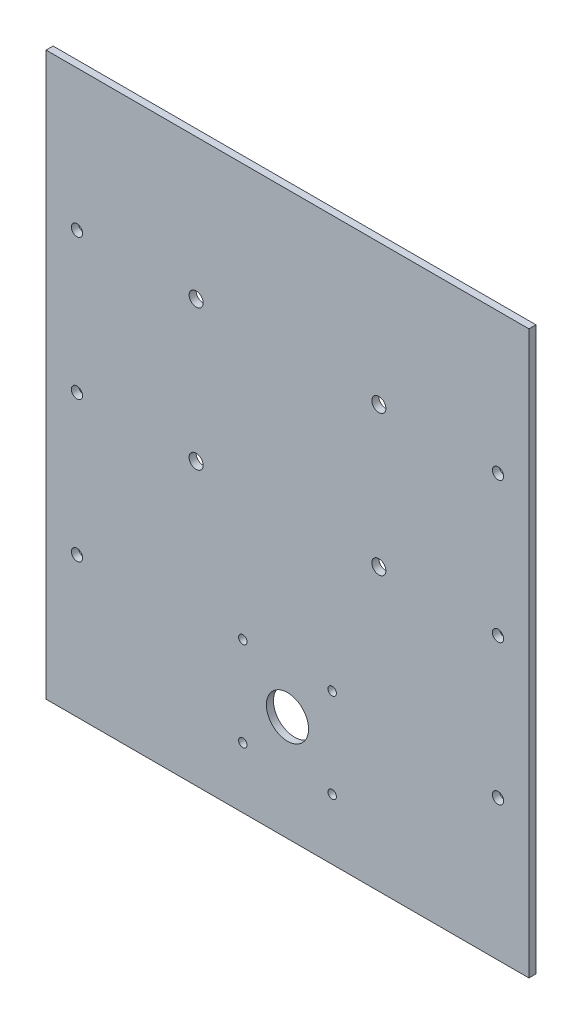
ISO-10303-21;
HEADER;
FILE_DESCRIPTION(('STEP AP214'),'2;1');
FILE_NAME('part.step','',(''),(''),'','','');
FILE_SCHEMA(('AUTOMOTIVE_DESIGN { 1 0 10303 214 1 1 1 1 }'));
ENDSEC;
DATA;
#1=APPLICATION_CONTEXT('core data for automotive mechanical design processes');
#2=APPLICATION_PROTOCOL_DEFINITION('international standard','automotive_design',2000,#1);
#3=PRODUCT_CONTEXT('',#1,'mechanical');
#4=PRODUCT('Part','Part','',(#3));
#5=PRODUCT_RELATED_PRODUCT_CATEGORY('part','',(#4));
#6=PRODUCT_DEFINITION_FORMATION('','',#4);
#7=PRODUCT_DEFINITION_CONTEXT('part definition',#1,'design');
#8=PRODUCT_DEFINITION('design','',#6,#7);
#9=PRODUCT_DEFINITION_SHAPE('','',#8);
#10=(LENGTH_UNIT() NAMED_UNIT(*) SI_UNIT(.MILLI.,.METRE.));
#11=(NAMED_UNIT(*) PLANE_ANGLE_UNIT() SI_UNIT($,.RADIAN.));
#12=(NAMED_UNIT(*) SI_UNIT($,.STERADIAN.) SOLID_ANGLE_UNIT());
#13=UNCERTAINTY_MEASURE_WITH_UNIT(LENGTH_MEASURE(1.E-05),#10,'distance_accuracy_value','');
#14=(GEOMETRIC_REPRESENTATION_CONTEXT(3) GLOBAL_UNCERTAINTY_ASSIGNED_CONTEXT((#13)) GLOBAL_UNIT_ASSIGNED_CONTEXT((#10,
#11,#12)) REPRESENTATION_CONTEXT('',''));
#15=CARTESIAN_POINT('',(0.,0.,0.));
#16=DIRECTION('',(0.,0.,1.));
#17=DIRECTION('',(1.,0.,0.));
#18=AXIS2_PLACEMENT_3D('',#15,#16,#17);
#19=CARTESIAN_POINT('',(-99.9999999999999,200.,0.));
#20=DIRECTION('',(0.,-1.,0.));
#21=DIRECTION('',(-1.,0.,0.));
#22=AXIS2_PLACEMENT_3D('',#19,#20,#21);
#23=PLANE('',#22);
#24=DIRECTION('',(-1.,0.,0.));
#25=VECTOR('',#24,1.);
#26=CARTESIAN_POINT('',(-99.9999999999999,200.,0.));
#27=LINE('',#26,#25);
#28=CARTESIAN_POINT('',(171.780972450962,200.,0.));
#29=VERTEX_POINT('',#28);
#30=CARTESIAN_POINT('',(-171.780972450962,200.,0.));
#31=VERTEX_POINT('',#30);
#32=EDGE_CURVE('E79',#29,#31,#27,.T.);
#33=ORIENTED_EDGE('',*,*,#32,.T.);
#34=DIRECTION('',(0.,0.,-1.));
#35=VECTOR('',#34,1.);
#36=CARTESIAN_POINT('',(-171.780972450962,200.,0.));
#37=LINE('',#36,#35);
#38=CARTESIAN_POINT('',(-171.780972450962,200.,5.));
#39=VERTEX_POINT('',#38);
#40=EDGE_CURVE('E99',#39,#31,#37,.T.);
#41=ORIENTED_EDGE('',*,*,#40,.F.);
#42=DIRECTION('',(-1.,0.,0.));
#43=VECTOR('',#42,1.);
#44=CARTESIAN_POINT('',(0.,200.,5.));
#45=LINE('',#44,#43);
#46=CARTESIAN_POINT('',(171.780972450962,200.,5.));
#47=VERTEX_POINT('',#46);
#48=EDGE_CURVE('E67',#47,#39,#45,.T.);
#49=ORIENTED_EDGE('',*,*,#48,.F.);
#50=DIRECTION('',(0.,0.,-1.));
#51=VECTOR('',#50,1.);
#52=CARTESIAN_POINT('',(171.780972450962,200.,0.));
#53=LINE('',#52,#51);
#54=EDGE_CURVE('E97',#47,#29,#53,.T.);
#55=ORIENTED_EDGE('',*,*,#54,.T.);
#56=EDGE_LOOP('',(#33,#41,#49,#55));
#57=FACE_BOUND('',#56,.T.);
#58=ADVANCED_FACE('F47',(#57),#23,.F.);
#59=CARTESIAN_POINT('',(100.,-200.,0.));
#60=DIRECTION('',(0.,1.,0.));
#61=DIRECTION('',(1.,0.,0.));
#62=AXIS2_PLACEMENT_3D('',#59,#60,#61);
#63=PLANE('',#62);
#64=DIRECTION('',(1.,0.,0.));
#65=VECTOR('',#64,1.);
#66=CARTESIAN_POINT('',(100.,-200.,0.));
#67=LINE('',#66,#65);
#68=CARTESIAN_POINT('',(-171.780972450962,-200.,0.));
#69=VERTEX_POINT('',#68);
#70=CARTESIAN_POINT('',(171.780972450962,-200.,0.));
#71=VERTEX_POINT('',#70);
#72=EDGE_CURVE('E94',#69,#71,#67,.T.);
#73=ORIENTED_EDGE('',*,*,#72,.T.);
#74=DIRECTION('',(0.,0.,-1.));
#75=VECTOR('',#74,1.);
#76=CARTESIAN_POINT('',(171.780972450962,-200.,0.));
#77=LINE('',#76,#75);
#78=CARTESIAN_POINT('',(171.780972450962,-200.,5.));
#79=VERTEX_POINT('',#78);
#80=EDGE_CURVE('E146',#79,#71,#77,.T.);
#81=ORIENTED_EDGE('',*,*,#80,.F.);
#82=DIRECTION('',(-1.,0.,0.));
#83=VECTOR('',#82,1.);
#84=CARTESIAN_POINT('',(0.,-200.,5.));
#85=LINE('',#84,#83);
#86=CARTESIAN_POINT('',(-171.780972450962,-200.,5.));
#87=VERTEX_POINT('',#86);
#88=EDGE_CURVE('E87',#87,#79,#85,.F.);
#89=ORIENTED_EDGE('',*,*,#88,.F.);
#90=DIRECTION('',(0.,0.,-1.));
#91=VECTOR('',#90,1.);
#92=CARTESIAN_POINT('',(-171.780972450962,-200.,0.));
#93=LINE('',#92,#91);
#94=EDGE_CURVE('E153',#87,#69,#93,.T.);
#95=ORIENTED_EDGE('',*,*,#94,.T.);
#96=EDGE_LOOP('',(#73,#81,#89,#95));
#97=FACE_BOUND('',#96,.T.);
#98=ADVANCED_FACE('F269',(#97),#63,.F.);
#99=CARTESIAN_POINT('',(-31.7973148823079,-156.797314882308,0.));
#100=DIRECTION('',(0.,0.,-1.));
#101=DIRECTION('',(-1.,0.,0.));
#102=AXIS2_PLACEMENT_3D('',#99,#100,#101);
#103=CYLINDRICAL_SURFACE('',#102,3.);
#104=CARTESIAN_POINT('',(-31.7973148823079,-156.797314882308,0.));
#105=DIRECTION('',(0.,0.,1.));
#106=DIRECTION('',(1.,0.,0.));
#107=AXIS2_PLACEMENT_3D('',#104,#105,#106);
#108=CIRCLE('',#107,3.);
#109=CARTESIAN_POINT('',(-28.7973148823079,-156.797314882308,0.));
#110=VERTEX_POINT('',#109);
#111=EDGE_CURVE('E183',#110,#110,#108,.T.);
#112=ORIENTED_EDGE('',*,*,#111,.F.);
#113=EDGE_LOOP('',(#112));
#114=FACE_BOUND('',#113,.T.);
#115=CARTESIAN_POINT('',(-31.7973148823079,-156.797314882308,5.));
#116=DIRECTION('',(0.,0.,1.));
#117=DIRECTION('',(1.,0.,0.));
#118=AXIS2_PLACEMENT_3D('',#115,#116,#117);
#119=CIRCLE('',#118,3.);
#120=CARTESIAN_POINT('',(-28.7973148823079,-156.797314882308,5.));
#121=VERTEX_POINT('',#120);
#122=EDGE_CURVE('E152',#121,#121,#119,.T.);
#123=ORIENTED_EDGE('',*,*,#122,.T.);
#124=EDGE_LOOP('',(#123));
#125=FACE_BOUND('',#124,.T.);
#126=ADVANCED_FACE('F274',(#114,#125),#103,.F.);
#127=CARTESIAN_POINT('',(31.797314882308,-93.2026851176922,0.));
#128=DIRECTION('',(0.,0.,-1.));
#129=DIRECTION('',(-1.,0.,0.));
#130=AXIS2_PLACEMENT_3D('',#127,#128,#129);
#131=CYLINDRICAL_SURFACE('',#130,3.);
#132=CARTESIAN_POINT('',(31.797314882308,-93.2026851176922,0.));
#133=DIRECTION('',(0.,0.,1.));
#134=DIRECTION('',(1.,0.,0.));
#135=AXIS2_PLACEMENT_3D('',#132,#133,#134);
#136=CIRCLE('',#135,3.);
#137=CARTESIAN_POINT('',(34.797314882308,-93.2026851176922,0.));
#138=VERTEX_POINT('',#137);
#139=EDGE_CURVE('E187',#138,#138,#136,.T.);
#140=ORIENTED_EDGE('',*,*,#139,.F.);
#141=EDGE_LOOP('',(#140));
#142=FACE_BOUND('',#141,.T.);
#143=CARTESIAN_POINT('',(31.797314882308,-93.2026851176922,5.));
#144=DIRECTION('',(0.,0.,1.));
#145=DIRECTION('',(1.,0.,0.));
#146=AXIS2_PLACEMENT_3D('',#143,#144,#145);
#147=CIRCLE('',#146,3.);
#148=CARTESIAN_POINT('',(34.797314882308,-93.2026851176922,5.));
#149=VERTEX_POINT('',#148);
#150=EDGE_CURVE('E224',#149,#149,#147,.T.);
#151=ORIENTED_EDGE('',*,*,#150,.T.);
#152=EDGE_LOOP('',(#151));
#153=FACE_BOUND('',#152,.T.);
#154=ADVANCED_FACE('F280',(#142,#153),#131,.F.);
#155=CARTESIAN_POINT('',(65.,0.,0.));
#156=DIRECTION('',(0.,0.,-1.));
#157=DIRECTION('',(-1.,0.,0.));
#158=AXIS2_PLACEMENT_3D('',#155,#156,#157);
#159=CYLINDRICAL_SURFACE('',#158,5.);
#160=CARTESIAN_POINT('',(65.,0.,0.));
#161=DIRECTION('',(0.,0.,1.));
#162=DIRECTION('',(1.,0.,0.));
#163=AXIS2_PLACEMENT_3D('',#160,#161,#162);
#164=CIRCLE('',#163,5.);
#165=CARTESIAN_POINT('',(70.,0.,0.));
#166=VERTEX_POINT('',#165);
#167=EDGE_CURVE('E191',#166,#166,#164,.T.);
#168=ORIENTED_EDGE('',*,*,#167,.F.);
#169=EDGE_LOOP('',(#168));
#170=FACE_BOUND('',#169,.T.);
#171=CARTESIAN_POINT('',(65.,0.,5.));
#172=DIRECTION('',(0.,0.,1.));
#173=DIRECTION('',(1.,0.,0.));
#174=AXIS2_PLACEMENT_3D('',#171,#172,#173);
#175=CIRCLE('',#174,5.);
#176=CARTESIAN_POINT('',(70.,0.,5.));
#177=VERTEX_POINT('',#176);
#178=EDGE_CURVE('E228',#177,#177,#175,.T.);
#179=ORIENTED_EDGE('',*,*,#178,.T.);
#180=EDGE_LOOP('',(#179));
#181=FACE_BOUND('',#180,.T.);
#182=ADVANCED_FACE('F284',(#170,#181),#159,.F.);
#183=CARTESIAN_POINT('',(-65.,100.,0.));
#184=DIRECTION('',(0.,0.,-1.));
#185=DIRECTION('',(-1.,0.,0.));
#186=AXIS2_PLACEMENT_3D('',#183,#184,#185);
#187=CYLINDRICAL_SURFACE('',#186,5.);
#188=CARTESIAN_POINT('',(-65.,100.,0.));
#189=DIRECTION('',(0.,0.,1.));
#190=DIRECTION('',(1.,0.,0.));
#191=AXIS2_PLACEMENT_3D('',#188,#189,#190);
#192=CIRCLE('',#191,5.);
#193=CARTESIAN_POINT('',(-60.,100.,0.));
#194=VERTEX_POINT('',#193);
#195=EDGE_CURVE('E195',#194,#194,#192,.T.);
#196=ORIENTED_EDGE('',*,*,#195,.F.);
#197=EDGE_LOOP('',(#196));
#198=FACE_BOUND('',#197,.T.);
#199=CARTESIAN_POINT('',(-65.,100.,5.));
#200=DIRECTION('',(0.,0.,1.));
#201=DIRECTION('',(1.,0.,0.));
#202=AXIS2_PLACEMENT_3D('',#199,#200,#201);
#203=CIRCLE('',#202,5.);
#204=CARTESIAN_POINT('',(-60.,100.,5.));
#205=VERTEX_POINT('',#204);
#206=EDGE_CURVE('E102',#205,#205,#203,.T.);
#207=ORIENTED_EDGE('',*,*,#206,.T.);
#208=EDGE_LOOP('',(#207));
#209=FACE_BOUND('',#208,.T.);
#210=ADVANCED_FACE('F288',(#198,#209),#187,.F.);
#211=CARTESIAN_POINT('',(-65.,0.,0.));
#212=DIRECTION('',(0.,0.,-1.));
#213=DIRECTION('',(-1.,0.,0.));
#214=AXIS2_PLACEMENT_3D('',#211,#212,#213);
#215=CYLINDRICAL_SURFACE('',#214,5.);
#216=CARTESIAN_POINT('',(-65.,0.,0.));
#217=DIRECTION('',(0.,0.,1.));
#218=DIRECTION('',(1.,0.,0.));
#219=AXIS2_PLACEMENT_3D('',#216,#217,#218);
#220=CIRCLE('',#219,5.);
#221=CARTESIAN_POINT('',(-60.,0.,0.));
#222=VERTEX_POINT('',#221);
#223=EDGE_CURVE('E203',#222,#222,#220,.T.);
#224=ORIENTED_EDGE('',*,*,#223,.F.);
#225=EDGE_LOOP('',(#224));
#226=FACE_BOUND('',#225,.T.);
#227=CARTESIAN_POINT('',(-65.,0.,5.));
#228=DIRECTION('',(0.,0.,1.));
#229=DIRECTION('',(1.,0.,0.));
#230=AXIS2_PLACEMENT_3D('',#227,#228,#229);
#231=CIRCLE('',#230,5.);
#232=CARTESIAN_POINT('',(-60.,0.,5.));
#233=VERTEX_POINT('',#232);
#234=EDGE_CURVE('E219',#233,#233,#231,.T.);
#235=ORIENTED_EDGE('',*,*,#234,.T.);
#236=EDGE_LOOP('',(#235));
#237=FACE_BOUND('',#236,.T.);
#238=ADVANCED_FACE('F292',(#226,#237),#215,.F.);
#239=CARTESIAN_POINT('',(65.,100.,0.));
#240=DIRECTION('',(0.,0.,-1.));
#241=DIRECTION('',(-1.,0.,0.));
#242=AXIS2_PLACEMENT_3D('',#239,#240,#241);
#243=CYLINDRICAL_SURFACE('',#242,5.00000000000001);
#244=CARTESIAN_POINT('',(65.,100.,0.));
#245=DIRECTION('',(0.,0.,1.));
#246=DIRECTION('',(1.,0.,0.));
#247=AXIS2_PLACEMENT_3D('',#244,#245,#246);
#248=CIRCLE('',#247,5.00000000000001);
#249=CARTESIAN_POINT('',(70.,100.,0.));
#250=VERTEX_POINT('',#249);
#251=EDGE_CURVE('E207',#250,#250,#248,.T.);
#252=ORIENTED_EDGE('',*,*,#251,.F.);
#253=EDGE_LOOP('',(#252));
#254=FACE_BOUND('',#253,.T.);
#255=CARTESIAN_POINT('',(65.,100.,5.));
#256=DIRECTION('',(0.,0.,1.));
#257=DIRECTION('',(1.,0.,0.));
#258=AXIS2_PLACEMENT_3D('',#255,#256,#257);
#259=CIRCLE('',#258,5.00000000000001);
#260=CARTESIAN_POINT('',(70.,100.,5.));
#261=VERTEX_POINT('',#260);
#262=EDGE_CURVE('E238',#261,#261,#259,.T.);
#263=ORIENTED_EDGE('',*,*,#262,.T.);
#264=EDGE_LOOP('',(#263));
#265=FACE_BOUND('',#264,.T.);
#266=ADVANCED_FACE('F296',(#254,#265),#243,.F.);
#267=CARTESIAN_POINT('',(0.,-125.,0.));
#268=DIRECTION('',(0.,0.,-1.));
#269=DIRECTION('',(-1.,0.,0.));
#270=AXIS2_PLACEMENT_3D('',#267,#268,#269);
#271=CYLINDRICAL_SURFACE('',#270,15.);
#272=CARTESIAN_POINT('',(0.,-125.,0.));
#273=DIRECTION('',(0.,0.,1.));
#274=DIRECTION('',(1.,0.,0.));
#275=AXIS2_PLACEMENT_3D('',#272,#273,#274);
#276=CIRCLE('',#275,15.);
#277=CARTESIAN_POINT('',(15.,-125.,0.));
#278=VERTEX_POINT('',#277);
#279=EDGE_CURVE('E211',#278,#278,#276,.T.);
#280=ORIENTED_EDGE('',*,*,#279,.F.);
#281=EDGE_LOOP('',(#280));
#282=FACE_BOUND('',#281,.T.);
#283=CARTESIAN_POINT('',(0.,-125.,5.));
#284=DIRECTION('',(0.,0.,1.));
#285=DIRECTION('',(1.,0.,0.));
#286=AXIS2_PLACEMENT_3D('',#283,#284,#285);
#287=CIRCLE('',#286,15.);
#288=CARTESIAN_POINT('',(15.,-125.,5.));
#289=VERTEX_POINT('',#288);
#290=EDGE_CURVE('E242',#289,#289,#287,.T.);
#291=ORIENTED_EDGE('',*,*,#290,.T.);
#292=EDGE_LOOP('',(#291));
#293=FACE_BOUND('',#292,.T.);
#294=ADVANCED_FACE('F265',(#282,#293),#271,.F.);
#295=CARTESIAN_POINT('',(-31.7973148823079,-93.2026851176921,0.));
#296=DIRECTION('',(0.,0.,-1.));
#297=DIRECTION('',(-1.,0.,0.));
#298=AXIS2_PLACEMENT_3D('',#295,#296,#297);
#299=CYLINDRICAL_SURFACE('',#298,3.);
#300=CARTESIAN_POINT('',(-31.7973148823079,-93.2026851176921,0.));
#301=DIRECTION('',(0.,0.,1.));
#302=DIRECTION('',(1.,0.,0.));
#303=AXIS2_PLACEMENT_3D('',#300,#301,#302);
#304=CIRCLE('',#303,3.);
#305=CARTESIAN_POINT('',(-28.7973148823079,-93.2026851176921,0.));
#306=VERTEX_POINT('',#305);
#307=EDGE_CURVE('E58',#306,#306,#304,.F.);
#308=ORIENTED_EDGE('',*,*,#307,.T.);
#309=EDGE_LOOP('',(#308));
#310=FACE_BOUND('',#309,.T.);
#311=CARTESIAN_POINT('',(-31.7973148823079,-93.2026851176921,5.));
#312=DIRECTION('',(0.,0.,1.));
#313=DIRECTION('',(1.,0.,0.));
#314=AXIS2_PLACEMENT_3D('',#311,#312,#313);
#315=CIRCLE('',#314,3.);
#316=CARTESIAN_POINT('',(-28.7973148823079,-93.2026851176921,5.));
#317=VERTEX_POINT('',#316);
#318=EDGE_CURVE('E245',#317,#317,#315,.F.);
#319=ORIENTED_EDGE('',*,*,#318,.F.);
#320=EDGE_LOOP('',(#319));
#321=FACE_BOUND('',#320,.T.);
#322=ADVANCED_FACE('F258',(#310,#321),#299,.F.);
#323=CARTESIAN_POINT('',(31.797314882308,-156.797314882308,0.));
#324=DIRECTION('',(0.,0.,-1.));
#325=DIRECTION('',(-1.,0.,0.));
#326=AXIS2_PLACEMENT_3D('',#323,#324,#325);
#327=CYLINDRICAL_SURFACE('',#326,3.);
#328=CARTESIAN_POINT('',(31.797314882308,-156.797314882308,0.));
#329=DIRECTION('',(0.,0.,1.));
#330=DIRECTION('',(1.,0.,0.));
#331=AXIS2_PLACEMENT_3D('',#328,#329,#330);
#332=CIRCLE('',#331,3.);
#333=CARTESIAN_POINT('',(34.797314882308,-156.797314882308,0.));
#334=VERTEX_POINT('',#333);
#335=EDGE_CURVE('E12',#334,#334,#332,.F.);
#336=ORIENTED_EDGE('',*,*,#335,.T.);
#337=EDGE_LOOP('',(#336));
#338=FACE_BOUND('',#337,.T.);
#339=CARTESIAN_POINT('',(31.797314882308,-156.797314882308,5.));
#340=DIRECTION('',(0.,0.,1.));
#341=DIRECTION('',(1.,0.,0.));
#342=AXIS2_PLACEMENT_3D('',#339,#340,#341);
#343=CIRCLE('',#342,3.);
#344=CARTESIAN_POINT('',(34.797314882308,-156.797314882308,5.));
#345=VERTEX_POINT('',#344);
#346=EDGE_CURVE('E51',#345,#345,#343,.F.);
#347=ORIENTED_EDGE('',*,*,#346,.F.);
#348=EDGE_LOOP('',(#347));
#349=FACE_BOUND('',#348,.T.);
#350=ADVANCED_FACE('F256',(#338,#349),#327,.F.);
#351=CARTESIAN_POINT('',(0.,0.,0.));
#352=DIRECTION('',(0.,0.,-1.));
#353=DIRECTION('',(-1.,0.,0.));
#354=AXIS2_PLACEMENT_3D('',#351,#352,#353);
#355=PLANE('',#354);
#356=ORIENTED_EDGE('',*,*,#111,.T.);
#357=EDGE_LOOP('',(#356));
#358=FACE_BOUND('',#357,.T.);
#359=ORIENTED_EDGE('',*,*,#139,.T.);
#360=EDGE_LOOP('',(#359));
#361=FACE_BOUND('',#360,.T.);
#362=ORIENTED_EDGE('',*,*,#167,.T.);
#363=EDGE_LOOP('',(#362));
#364=FACE_BOUND('',#363,.T.);
#365=ORIENTED_EDGE('',*,*,#195,.T.);
#366=EDGE_LOOP('',(#365));
#367=FACE_BOUND('',#366,.T.);
#368=ORIENTED_EDGE('',*,*,#32,.F.);
#369=DIRECTION('',(0.,1.,0.));
#370=VECTOR('',#369,1.);
#371=CARTESIAN_POINT('',(171.780972450962,-200.,0.));
#372=LINE('',#371,#370);
#373=EDGE_CURVE('E109',#71,#29,#372,.T.);
#374=ORIENTED_EDGE('',*,*,#373,.F.);
#375=ORIENTED_EDGE('',*,*,#72,.F.);
#376=DIRECTION('',(0.,-1.,0.));
#377=VECTOR('',#376,1.);
#378=CARTESIAN_POINT('',(-171.780972450962,-200.,0.));
#379=LINE('',#378,#377);
#380=EDGE_CURVE('E121',#31,#69,#379,.T.);
#381=ORIENTED_EDGE('',*,*,#380,.F.);
#382=EDGE_LOOP('',(#368,#374,#375,#381));
#383=FACE_BOUND('',#382,.T.);
#384=ORIENTED_EDGE('',*,*,#223,.T.);
#385=EDGE_LOOP('',(#384));
#386=FACE_BOUND('',#385,.T.);
#387=ORIENTED_EDGE('',*,*,#251,.T.);
#388=EDGE_LOOP('',(#387));
#389=FACE_BOUND('',#388,.T.);
#390=ORIENTED_EDGE('',*,*,#279,.T.);
#391=EDGE_LOOP('',(#390));
#392=FACE_BOUND('',#391,.T.);
#393=ORIENTED_EDGE('',*,*,#307,.F.);
#394=EDGE_LOOP('',(#393));
#395=FACE_BOUND('',#394,.T.);
#396=ORIENTED_EDGE('',*,*,#335,.F.);
#397=EDGE_LOOP('',(#396));
#398=FACE_BOUND('',#397,.T.);
#399=CARTESIAN_POINT('',(-149.780972450962,100.,0.));
#400=DIRECTION('',(0.,0.,1.));
#401=DIRECTION('',(1.,0.,0.));
#402=AXIS2_PLACEMENT_3D('',#399,#400,#401);
#403=CIRCLE('',#402,4.00000000000001);
#404=CARTESIAN_POINT('',(-145.780972450962,100.,0.));
#405=VERTEX_POINT('',#404);
#406=EDGE_CURVE('E164',#405,#405,#403,.T.);
#407=ORIENTED_EDGE('',*,*,#406,.T.);
#408=EDGE_LOOP('',(#407));
#409=FACE_BOUND('',#408,.T.);
#410=CARTESIAN_POINT('',(-149.780972450962,0.,0.));
#411=DIRECTION('',(0.,0.,1.));
#412=DIRECTION('',(1.,0.,0.));
#413=AXIS2_PLACEMENT_3D('',#410,#411,#412);
#414=CIRCLE('',#413,4.);
#415=CARTESIAN_POINT('',(-145.780972450962,0.,0.));
#416=VERTEX_POINT('',#415);
#417=EDGE_CURVE('E160',#416,#416,#414,.T.);
#418=ORIENTED_EDGE('',*,*,#417,.T.);
#419=EDGE_LOOP('',(#418));
#420=FACE_BOUND('',#419,.T.);
#421=CARTESIAN_POINT('',(-149.780972450962,-100.,0.));
#422=DIRECTION('',(0.,0.,1.));
#423=DIRECTION('',(1.,0.,0.));
#424=AXIS2_PLACEMENT_3D('',#421,#422,#423);
#425=CIRCLE('',#424,4.00000000000001);
#426=CARTESIAN_POINT('',(-145.780972450962,-100.,0.));
#427=VERTEX_POINT('',#426);
#428=EDGE_CURVE('E156',#427,#427,#425,.T.);
#429=ORIENTED_EDGE('',*,*,#428,.T.);
#430=EDGE_LOOP('',(#429));
#431=FACE_BOUND('',#430,.T.);
#432=CARTESIAN_POINT('',(149.780972450962,100.,0.));
#433=DIRECTION('',(0.,0.,-1.));
#434=DIRECTION('',(-1.,0.,0.));
#435=AXIS2_PLACEMENT_3D('',#432,#433,#434);
#436=CIRCLE('',#435,4.00000000000001);
#437=CARTESIAN_POINT('',(145.780972450962,100.,0.));
#438=VERTEX_POINT('',#437);
#439=EDGE_CURVE('E112',#438,#438,#436,.T.);
#440=ORIENTED_EDGE('',*,*,#439,.F.);
#441=EDGE_LOOP('',(#440));
#442=FACE_BOUND('',#441,.T.);
#443=CARTESIAN_POINT('',(149.780972450962,0.,0.));
#444=DIRECTION('',(0.,0.,-1.));
#445=DIRECTION('',(-1.,0.,0.));
#446=AXIS2_PLACEMENT_3D('',#443,#444,#445);
#447=CIRCLE('',#446,4.);
#448=CARTESIAN_POINT('',(145.780972450962,0.,0.));
#449=VERTEX_POINT('',#448);
#450=EDGE_CURVE('E136',#449,#449,#447,.T.);
#451=ORIENTED_EDGE('',*,*,#450,.F.);
#452=EDGE_LOOP('',(#451));
#453=FACE_BOUND('',#452,.T.);
#454=CARTESIAN_POINT('',(149.780972450962,-100.,0.));
#455=DIRECTION('',(0.,0.,-1.));
#456=DIRECTION('',(-1.,0.,0.));
#457=AXIS2_PLACEMENT_3D('',#454,#455,#456);
#458=CIRCLE('',#457,4.00000000000001);
#459=CARTESIAN_POINT('',(145.780972450962,-100.,0.));
#460=VERTEX_POINT('',#459);
#461=EDGE_CURVE('E140',#460,#460,#458,.T.);
#462=ORIENTED_EDGE('',*,*,#461,.F.);
#463=EDGE_LOOP('',(#462));
#464=FACE_BOUND('',#463,.T.);
#465=ADVANCED_FACE('F49',(#358,#361,#364,#367,#383,#386,#389,#392,#395,#398,#409,#420,#431,#442,
#453,#464),#355,.T.);
#466=CARTESIAN_POINT('',(0.,0.,5.));
#467=DIRECTION('',(0.,0.,-1.));
#468=DIRECTION('',(-1.,0.,0.));
#469=AXIS2_PLACEMENT_3D('',#466,#467,#468);
#470=PLANE('',#469);
#471=ORIENTED_EDGE('',*,*,#122,.F.);
#472=EDGE_LOOP('',(#471));
#473=FACE_BOUND('',#472,.T.);
#474=ORIENTED_EDGE('',*,*,#150,.F.);
#475=EDGE_LOOP('',(#474));
#476=FACE_BOUND('',#475,.T.);
#477=ORIENTED_EDGE('',*,*,#178,.F.);
#478=EDGE_LOOP('',(#477));
#479=FACE_BOUND('',#478,.T.);
#480=ORIENTED_EDGE('',*,*,#206,.F.);
#481=EDGE_LOOP('',(#480));
#482=FACE_BOUND('',#481,.T.);
#483=ORIENTED_EDGE('',*,*,#48,.T.);
#484=DIRECTION('',(0.,1.,0.));
#485=VECTOR('',#484,1.);
#486=CARTESIAN_POINT('',(-171.780972450962,-200.,5.));
#487=LINE('',#486,#485);
#488=EDGE_CURVE('E149',#39,#87,#487,.F.);
#489=ORIENTED_EDGE('',*,*,#488,.T.);
#490=ORIENTED_EDGE('',*,*,#88,.T.);
#491=DIRECTION('',(0.,1.,0.));
#492=VECTOR('',#491,1.);
#493=CARTESIAN_POINT('',(171.780972450962,200.,5.));
#494=LINE('',#493,#492);
#495=EDGE_CURVE('E107',#79,#47,#494,.T.);
#496=ORIENTED_EDGE('',*,*,#495,.T.);
#497=EDGE_LOOP('',(#483,#489,#490,#496));
#498=FACE_BOUND('',#497,.T.);
#499=ORIENTED_EDGE('',*,*,#234,.F.);
#500=EDGE_LOOP('',(#499));
#501=FACE_BOUND('',#500,.T.);
#502=ORIENTED_EDGE('',*,*,#262,.F.);
#503=EDGE_LOOP('',(#502));
#504=FACE_BOUND('',#503,.T.);
#505=ORIENTED_EDGE('',*,*,#290,.F.);
#506=EDGE_LOOP('',(#505));
#507=FACE_BOUND('',#506,.T.);
#508=ORIENTED_EDGE('',*,*,#318,.T.);
#509=EDGE_LOOP('',(#508));
#510=FACE_BOUND('',#509,.T.);
#511=ORIENTED_EDGE('',*,*,#346,.T.);
#512=EDGE_LOOP('',(#511));
#513=FACE_BOUND('',#512,.T.);
#514=CARTESIAN_POINT('',(-149.780972450962,100.,5.));
#515=DIRECTION('',(0.,0.,1.));
#516=DIRECTION('',(1.,0.,0.));
#517=AXIS2_PLACEMENT_3D('',#514,#515,#516);
#518=CIRCLE('',#517,4.00000000000001);
#519=CARTESIAN_POINT('',(-145.780972450962,100.,5.));
#520=VERTEX_POINT('',#519);
#521=EDGE_CURVE('E168',#520,#520,#518,.T.);
#522=ORIENTED_EDGE('',*,*,#521,.F.);
#523=EDGE_LOOP('',(#522));
#524=FACE_BOUND('',#523,.T.);
#525=CARTESIAN_POINT('',(-149.780972450962,0.,5.));
#526=DIRECTION('',(0.,0.,1.));
#527=DIRECTION('',(1.,0.,0.));
#528=AXIS2_PLACEMENT_3D('',#525,#526,#527);
#529=CIRCLE('',#528,4.);
#530=CARTESIAN_POINT('',(-145.780972450962,0.,5.));
#531=VERTEX_POINT('',#530);
#532=EDGE_CURVE('E172',#531,#531,#529,.T.);
#533=ORIENTED_EDGE('',*,*,#532,.F.);
#534=EDGE_LOOP('',(#533));
#535=FACE_BOUND('',#534,.T.);
#536=CARTESIAN_POINT('',(-149.780972450962,-100.,5.));
#537=DIRECTION('',(0.,0.,1.));
#538=DIRECTION('',(1.,0.,0.));
#539=AXIS2_PLACEMENT_3D('',#536,#537,#538);
#540=CIRCLE('',#539,4.00000000000001);
#541=CARTESIAN_POINT('',(-145.780972450962,-100.,5.));
#542=VERTEX_POINT('',#541);
#543=EDGE_CURVE('E176',#542,#542,#540,.T.);
#544=ORIENTED_EDGE('',*,*,#543,.F.);
#545=EDGE_LOOP('',(#544));
#546=FACE_BOUND('',#545,.T.);
#547=CARTESIAN_POINT('',(149.780972450962,100.,5.));
#548=DIRECTION('',(0.,0.,-1.));
#549=DIRECTION('',(-1.,0.,0.));
#550=AXIS2_PLACEMENT_3D('',#547,#548,#549);
#551=CIRCLE('',#550,4.00000000000001);
#552=CARTESIAN_POINT('',(145.780972450962,100.,5.));
#553=VERTEX_POINT('',#552);
#554=EDGE_CURVE('E111',#553,#553,#551,.T.);
#555=ORIENTED_EDGE('',*,*,#554,.T.);
#556=EDGE_LOOP('',(#555));
#557=FACE_BOUND('',#556,.T.);
#558=CARTESIAN_POINT('',(149.780972450962,0.,5.));
#559=DIRECTION('',(0.,0.,-1.));
#560=DIRECTION('',(-1.,0.,0.));
#561=AXIS2_PLACEMENT_3D('',#558,#559,#560);
#562=CIRCLE('',#561,4.);
#563=CARTESIAN_POINT('',(145.780972450962,0.,5.));
#564=VERTEX_POINT('',#563);
#565=EDGE_CURVE('E124',#564,#564,#562,.T.);
#566=ORIENTED_EDGE('',*,*,#565,.T.);
#567=EDGE_LOOP('',(#566));
#568=FACE_BOUND('',#567,.T.);
#569=CARTESIAN_POINT('',(149.780972450962,-100.,5.));
#570=DIRECTION('',(0.,0.,-1.));
#571=DIRECTION('',(-1.,0.,0.));
#572=AXIS2_PLACEMENT_3D('',#569,#570,#571);
#573=CIRCLE('',#572,4.00000000000001);
#574=CARTESIAN_POINT('',(145.780972450962,-100.,5.));
#575=VERTEX_POINT('',#574);
#576=EDGE_CURVE('E117',#575,#575,#573,.T.);
#577=ORIENTED_EDGE('',*,*,#576,.T.);
#578=EDGE_LOOP('',(#577));
#579=FACE_BOUND('',#578,.T.);
#580=ADVANCED_FACE('F114',(#473,#476,#479,#482,#498,#501,#504,#507,#510,#513,#524,#535,#546,
#557,#568,#579),#470,.F.);
#581=CARTESIAN_POINT('',(-171.780972450962,-200.,0.));
#582=DIRECTION('',(-1.,0.,0.));
#583=DIRECTION('',(0.,-1.,0.));
#584=AXIS2_PLACEMENT_3D('',#581,#582,#583);
#585=PLANE('',#584);
#586=ORIENTED_EDGE('',*,*,#94,.F.);
#587=ORIENTED_EDGE('',*,*,#488,.F.);
#588=ORIENTED_EDGE('',*,*,#40,.T.);
#589=ORIENTED_EDGE('',*,*,#380,.T.);
#590=EDGE_LOOP('',(#586,#587,#588,#589));
#591=FACE_BOUND('',#590,.T.);
#592=ADVANCED_FACE('F310',(#591),#585,.T.);
#593=CARTESIAN_POINT('',(-149.780972450962,-100.,0.));
#594=DIRECTION('',(0.,0.,1.));
#595=DIRECTION('',(1.,0.,0.));
#596=AXIS2_PLACEMENT_3D('',#593,#594,#595);
#597=CYLINDRICAL_SURFACE('',#596,4.00000000000001);
#598=ORIENTED_EDGE('',*,*,#428,.F.);
#599=EDGE_LOOP('',(#598));
#600=FACE_BOUND('',#599,.T.);
#601=ORIENTED_EDGE('',*,*,#543,.T.);
#602=EDGE_LOOP('',(#601));
#603=FACE_BOUND('',#602,.T.);
#604=ADVANCED_FACE('F315',(#600,#603),#597,.F.);
#605=CARTESIAN_POINT('',(-149.780972450962,0.,0.));
#606=DIRECTION('',(0.,0.,1.));
#607=DIRECTION('',(1.,0.,0.));
#608=AXIS2_PLACEMENT_3D('',#605,#606,#607);
#609=CYLINDRICAL_SURFACE('',#608,4.);
#610=ORIENTED_EDGE('',*,*,#417,.F.);
#611=EDGE_LOOP('',(#610));
#612=FACE_BOUND('',#611,.T.);
#613=ORIENTED_EDGE('',*,*,#532,.T.);
#614=EDGE_LOOP('',(#613));
#615=FACE_BOUND('',#614,.T.);
#616=ADVANCED_FACE('F324',(#612,#615),#609,.F.);
#617=CARTESIAN_POINT('',(-149.780972450962,100.,0.));
#618=DIRECTION('',(0.,0.,1.));
#619=DIRECTION('',(1.,0.,0.));
#620=AXIS2_PLACEMENT_3D('',#617,#618,#619);
#621=CYLINDRICAL_SURFACE('',#620,4.00000000000001);
#622=ORIENTED_EDGE('',*,*,#406,.F.);
#623=EDGE_LOOP('',(#622));
#624=FACE_BOUND('',#623,.T.);
#625=ORIENTED_EDGE('',*,*,#521,.T.);
#626=EDGE_LOOP('',(#625));
#627=FACE_BOUND('',#626,.T.);
#628=ADVANCED_FACE('F321',(#624,#627),#621,.F.);
#629=CARTESIAN_POINT('',(171.780972450962,-200.,0.));
#630=DIRECTION('',(1.,0.,0.));
#631=DIRECTION('',(0.,1.,0.));
#632=AXIS2_PLACEMENT_3D('',#629,#630,#631);
#633=PLANE('',#632);
#634=ORIENTED_EDGE('',*,*,#54,.F.);
#635=ORIENTED_EDGE('',*,*,#495,.F.);
#636=ORIENTED_EDGE('',*,*,#80,.T.);
#637=ORIENTED_EDGE('',*,*,#373,.T.);
#638=EDGE_LOOP('',(#634,#635,#636,#637));
#639=FACE_BOUND('',#638,.T.);
#640=ADVANCED_FACE('F106',(#639),#633,.T.);
#641=CARTESIAN_POINT('',(149.780972450962,-100.,0.));
#642=DIRECTION('',(0.,0.,1.));
#643=DIRECTION('',(1.,0.,0.));
#644=AXIS2_PLACEMENT_3D('',#641,#642,#643);
#645=CYLINDRICAL_SURFACE('',#644,4.00000000000001);
#646=ORIENTED_EDGE('',*,*,#461,.T.);
#647=EDGE_LOOP('',(#646));
#648=FACE_BOUND('',#647,.T.);
#649=ORIENTED_EDGE('',*,*,#576,.F.);
#650=EDGE_LOOP('',(#649));
#651=FACE_BOUND('',#650,.T.);
#652=ADVANCED_FACE('F339',(#648,#651),#645,.F.);
#653=CARTESIAN_POINT('',(149.780972450962,0.,0.));
#654=DIRECTION('',(0.,0.,1.));
#655=DIRECTION('',(1.,0.,0.));
#656=AXIS2_PLACEMENT_3D('',#653,#654,#655);
#657=CYLINDRICAL_SURFACE('',#656,4.);
#658=ORIENTED_EDGE('',*,*,#450,.T.);
#659=EDGE_LOOP('',(#658));
#660=FACE_BOUND('',#659,.T.);
#661=ORIENTED_EDGE('',*,*,#565,.F.);
#662=EDGE_LOOP('',(#661));
#663=FACE_BOUND('',#662,.T.);
#664=ADVANCED_FACE('F335',(#660,#663),#657,.F.);
#665=CARTESIAN_POINT('',(149.780972450962,100.,0.));
#666=DIRECTION('',(0.,0.,1.));
#667=DIRECTION('',(1.,0.,0.));
#668=AXIS2_PLACEMENT_3D('',#665,#666,#667);
#669=CYLINDRICAL_SURFACE('',#668,4.00000000000001);
#670=ORIENTED_EDGE('',*,*,#439,.T.);
#671=EDGE_LOOP('',(#670));
#672=FACE_BOUND('',#671,.T.);
#673=ORIENTED_EDGE('',*,*,#554,.F.);
#674=EDGE_LOOP('',(#673));
#675=FACE_BOUND('',#674,.T.);
#676=ADVANCED_FACE('F332',(#672,#675),#669,.F.);
#677=CLOSED_SHELL('',(#58,#98,#126,#154,#182,#210,#238,#266,#294,#322,#350,#465,#580,#592,#604,
#616,#628,#640,#652,#664,#676));
#678=MANIFOLD_SOLID_BREP('B2',#677);
#679=ADVANCED_BREP_SHAPE_REPRESENTATION('',(#18,#678),#14);
#680=SHAPE_DEFINITION_REPRESENTATION(#9,#679);
ENDSEC;
END-ISO-10303-21;
